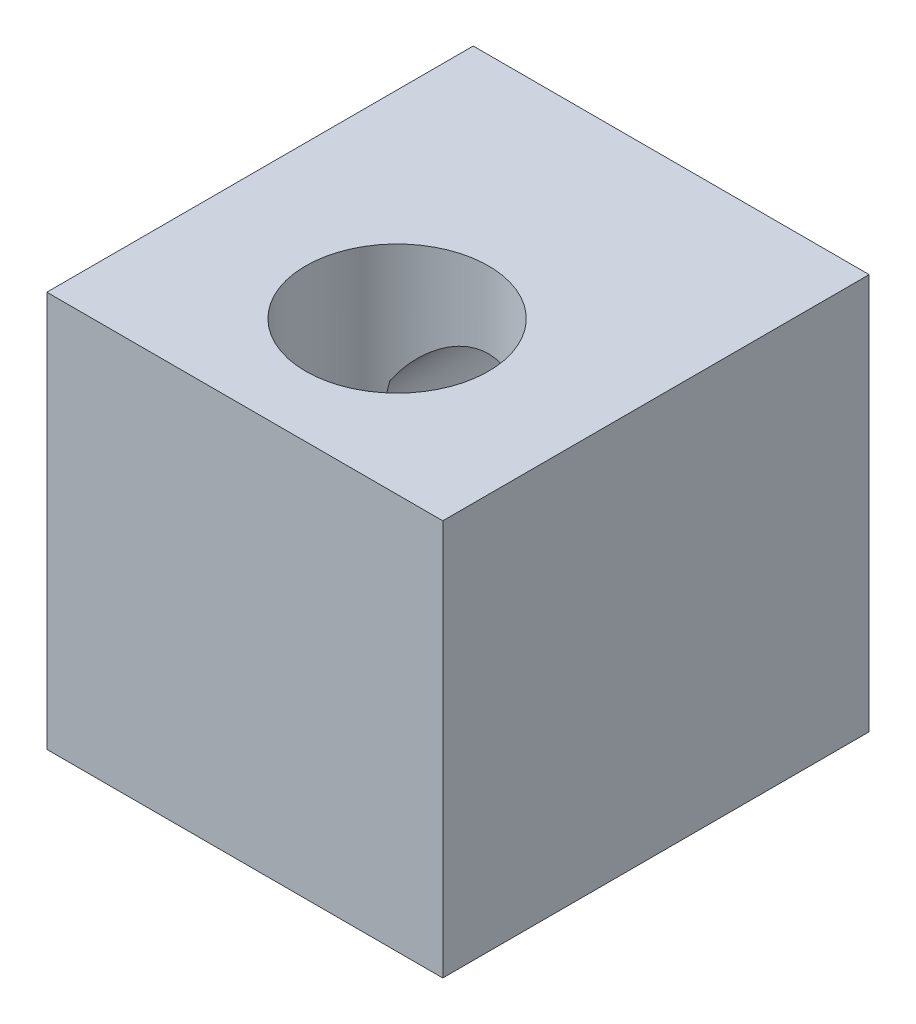
ISO-10303-21;
HEADER;
FILE_DESCRIPTION(('STEP AP214'),'2;1');
FILE_NAME('part.step','',(''),(''),'','','');
FILE_SCHEMA(('AUTOMOTIVE_DESIGN { 1 0 10303 214 1 1 1 1 }'));
ENDSEC;
DATA;
#1=APPLICATION_CONTEXT('core data for automotive mechanical design processes');
#2=APPLICATION_PROTOCOL_DEFINITION('international standard','automotive_design',2000,#1);
#3=PRODUCT_CONTEXT('',#1,'mechanical');
#4=PRODUCT('Part','Part','',(#3));
#5=PRODUCT_RELATED_PRODUCT_CATEGORY('part','',(#4));
#6=PRODUCT_DEFINITION_FORMATION('','',#4);
#7=PRODUCT_DEFINITION_CONTEXT('part definition',#1,'design');
#8=PRODUCT_DEFINITION('design','',#6,#7);
#9=PRODUCT_DEFINITION_SHAPE('','',#8);
#10=(LENGTH_UNIT() NAMED_UNIT(*) SI_UNIT(.MILLI.,.METRE.));
#11=(NAMED_UNIT(*) PLANE_ANGLE_UNIT() SI_UNIT($,.RADIAN.));
#12=(NAMED_UNIT(*) SI_UNIT($,.STERADIAN.) SOLID_ANGLE_UNIT());
#13=UNCERTAINTY_MEASURE_WITH_UNIT(LENGTH_MEASURE(1.E-05),#10,'distance_accuracy_value','');
#14=(GEOMETRIC_REPRESENTATION_CONTEXT(3) GLOBAL_UNCERTAINTY_ASSIGNED_CONTEXT((#13)) GLOBAL_UNIT_ASSIGNED_CONTEXT((#10,
#11,#12)) REPRESENTATION_CONTEXT('',''));
#15=CARTESIAN_POINT('',(0.,0.,0.));
#16=DIRECTION('',(0.,0.,1.));
#17=DIRECTION('',(1.,0.,0.));
#18=AXIS2_PLACEMENT_3D('',#15,#16,#17);
#19=CARTESIAN_POINT('',(-6.5,6.5,14.));
#20=DIRECTION('',(0.,-1.,0.));
#21=DIRECTION('',(0.,0.,-1.));
#22=AXIS2_PLACEMENT_3D('',#19,#20,#21);
#23=PLANE('',#22);
#24=DIRECTION('',(-1.,0.,0.));
#25=VECTOR('',#24,1.);
#26=CARTESIAN_POINT('',(-6.5,6.5,0.));
#27=LINE('',#26,#25);
#28=CARTESIAN_POINT('',(6.5,6.5,0.));
#29=VERTEX_POINT('',#28);
#30=CARTESIAN_POINT('',(-6.5,6.5,0.));
#31=VERTEX_POINT('',#30);
#32=EDGE_CURVE('E106',#29,#31,#27,.T.);
#33=ORIENTED_EDGE('',*,*,#32,.T.);
#34=DIRECTION('',(0.,0.,-1.));
#35=VECTOR('',#34,1.);
#36=CARTESIAN_POINT('',(-6.5,6.5,14.));
#37=LINE('',#36,#35);
#38=CARTESIAN_POINT('',(-6.5,6.5,14.));
#39=VERTEX_POINT('',#38);
#40=EDGE_CURVE('E179',#39,#31,#37,.T.);
#41=ORIENTED_EDGE('',*,*,#40,.F.);
#42=DIRECTION('',(-1.,0.,0.));
#43=VECTOR('',#42,1.);
#44=CARTESIAN_POINT('',(-6.5,6.5,14.));
#45=LINE('',#44,#43);
#46=CARTESIAN_POINT('',(6.5,6.5,14.));
#47=VERTEX_POINT('',#46);
#48=EDGE_CURVE('E85',#47,#39,#45,.T.);
#49=ORIENTED_EDGE('',*,*,#48,.F.);
#50=DIRECTION('',(0.,0.,-1.));
#51=VECTOR('',#50,1.);
#52=CARTESIAN_POINT('',(6.5,6.5,14.));
#53=LINE('',#52,#51);
#54=EDGE_CURVE('E176',#47,#29,#53,.T.);
#55=ORIENTED_EDGE('',*,*,#54,.T.);
#56=EDGE_LOOP('',(#33,#41,#49,#55));
#57=FACE_BOUND('',#56,.T.);
#58=CARTESIAN_POINT('',(0.,6.5,9.));
#59=DIRECTION('',(0.,1.,0.));
#60=DIRECTION('',(0.,0.,1.));
#61=AXIS2_PLACEMENT_3D('',#58,#59,#60);
#62=CIRCLE('',#61,3.);
#63=CARTESIAN_POINT('',(0.,6.5,12.));
#64=VERTEX_POINT('',#63);
#65=EDGE_CURVE('E135',#64,#64,#62,.T.);
#66=ORIENTED_EDGE('',*,*,#65,.F.);
#67=EDGE_LOOP('',(#66));
#68=FACE_BOUND('',#67,.T.);
#69=ADVANCED_FACE('F55',(#57,#68),#23,.F.);
#70=CARTESIAN_POINT('',(-6.5,-6.5,14.));
#71=DIRECTION('',(1.,0.,0.));
#72=DIRECTION('',(0.,1.,0.));
#73=AXIS2_PLACEMENT_3D('',#70,#71,#72);
#74=PLANE('',#73);
#75=DIRECTION('',(0.,-1.,0.));
#76=VECTOR('',#75,1.);
#77=CARTESIAN_POINT('',(-6.5,-6.5,0.));
#78=LINE('',#77,#76);
#79=CARTESIAN_POINT('',(-6.5,-6.5,0.));
#80=VERTEX_POINT('',#79);
#81=EDGE_CURVE('E191',#31,#80,#78,.T.);
#82=ORIENTED_EDGE('',*,*,#81,.T.);
#83=DIRECTION('',(0.,0.,-1.));
#84=VECTOR('',#83,1.);
#85=CARTESIAN_POINT('',(-6.5,-6.5,14.));
#86=LINE('',#85,#84);
#87=CARTESIAN_POINT('',(-6.5,-6.5,14.));
#88=VERTEX_POINT('',#87);
#89=EDGE_CURVE('E169',#88,#80,#86,.T.);
#90=ORIENTED_EDGE('',*,*,#89,.F.);
#91=DIRECTION('',(0.,-1.,0.));
#92=VECTOR('',#91,1.);
#93=CARTESIAN_POINT('',(-6.5,-6.5,14.));
#94=LINE('',#93,#92);
#95=EDGE_CURVE('E184',#39,#88,#94,.T.);
#96=ORIENTED_EDGE('',*,*,#95,.F.);
#97=ORIENTED_EDGE('',*,*,#40,.T.);
#98=EDGE_LOOP('',(#82,#90,#96,#97));
#99=FACE_BOUND('',#98,.T.);
#100=ADVANCED_FACE('F57',(#99),#74,.F.);
#101=CARTESIAN_POINT('',(-6.5,-6.5,14.));
#102=DIRECTION('',(0.,1.,0.));
#103=DIRECTION('',(-1.,0.,0.));
#104=AXIS2_PLACEMENT_3D('',#101,#102,#103);
#105=PLANE('',#104);
#106=CARTESIAN_POINT('',(0.,-6.5,9.));
#107=DIRECTION('',(0.,1.,0.));
#108=DIRECTION('',(-1.,0.,0.));
#109=AXIS2_PLACEMENT_3D('',#106,#107,#108);
#110=CIRCLE('',#109,3.);
#111=CARTESIAN_POINT('',(-2.99999999999997,-6.5,9.));
#112=VERTEX_POINT('',#111);
#113=EDGE_CURVE('E195',#112,#112,#110,.T.);
#114=ORIENTED_EDGE('',*,*,#113,.T.);
#115=EDGE_LOOP('',(#114));
#116=FACE_BOUND('',#115,.T.);
#117=DIRECTION('',(1.,0.,0.));
#118=VECTOR('',#117,1.);
#119=CARTESIAN_POINT('',(-6.5,-6.5,0.));
#120=LINE('',#119,#118);
#121=CARTESIAN_POINT('',(6.5,-6.5,0.));
#122=VERTEX_POINT('',#121);
#123=EDGE_CURVE('E188',#80,#122,#120,.T.);
#124=ORIENTED_EDGE('',*,*,#123,.T.);
#125=DIRECTION('',(0.,0.,-1.));
#126=VECTOR('',#125,1.);
#127=CARTESIAN_POINT('',(6.5,-6.5,14.));
#128=LINE('',#127,#126);
#129=CARTESIAN_POINT('',(6.5,-6.5,14.));
#130=VERTEX_POINT('',#129);
#131=EDGE_CURVE('E172',#130,#122,#128,.T.);
#132=ORIENTED_EDGE('',*,*,#131,.F.);
#133=DIRECTION('',(1.,0.,0.));
#134=VECTOR('',#133,1.);
#135=CARTESIAN_POINT('',(-6.5,-6.5,14.));
#136=LINE('',#135,#134);
#137=EDGE_CURVE('E114',#88,#130,#136,.T.);
#138=ORIENTED_EDGE('',*,*,#137,.F.);
#139=ORIENTED_EDGE('',*,*,#89,.T.);
#140=EDGE_LOOP('',(#124,#132,#138,#139));
#141=FACE_BOUND('',#140,.T.);
#142=ADVANCED_FACE('F232',(#116,#141),#105,.F.);
#143=CARTESIAN_POINT('',(6.5,-6.5,14.));
#144=DIRECTION('',(-1.,0.,0.));
#145=DIRECTION('',(0.,-1.,0.));
#146=AXIS2_PLACEMENT_3D('',#143,#144,#145);
#147=PLANE('',#146);
#148=DIRECTION('',(0.,1.,0.));
#149=VECTOR('',#148,1.);
#150=CARTESIAN_POINT('',(6.5,-6.5,0.));
#151=LINE('',#150,#149);
#152=EDGE_CURVE('E185',#122,#29,#151,.T.);
#153=ORIENTED_EDGE('',*,*,#152,.T.);
#154=ORIENTED_EDGE('',*,*,#54,.F.);
#155=DIRECTION('',(0.,1.,0.));
#156=VECTOR('',#155,1.);
#157=CARTESIAN_POINT('',(6.5,-6.5,14.));
#158=LINE('',#157,#156);
#159=EDGE_CURVE('E198',#130,#47,#158,.T.);
#160=ORIENTED_EDGE('',*,*,#159,.F.);
#161=ORIENTED_EDGE('',*,*,#131,.T.);
#162=EDGE_LOOP('',(#153,#154,#160,#161));
#163=FACE_BOUND('',#162,.T.);
#164=ADVANCED_FACE('F231',(#163),#147,.F.);
#165=CARTESIAN_POINT('',(0.,0.,14.));
#166=DIRECTION('',(0.,0.,-1.));
#167=DIRECTION('',(-1.,0.,0.));
#168=AXIS2_PLACEMENT_3D('',#165,#166,#167);
#169=PLANE('',#168);
#170=ORIENTED_EDGE('',*,*,#95,.T.);
#171=ORIENTED_EDGE('',*,*,#137,.T.);
#172=ORIENTED_EDGE('',*,*,#159,.T.);
#173=ORIENTED_EDGE('',*,*,#48,.T.);
#174=EDGE_LOOP('',(#170,#171,#172,#173));
#175=FACE_BOUND('',#174,.T.);
#176=ADVANCED_FACE('F220',(#175),#169,.F.);
#177=CARTESIAN_POINT('',(0.,0.,0.));
#178=DIRECTION('',(0.,0.,-1.));
#179=DIRECTION('',(-1.,0.,0.));
#180=AXIS2_PLACEMENT_3D('',#177,#178,#179);
#181=PLANE('',#180);
#182=CARTESIAN_POINT('',(0.,1.5,0.));
#183=DIRECTION('',(0.,0.,-1.));
#184=DIRECTION('',(-1.,0.,0.));
#185=AXIS2_PLACEMENT_3D('',#182,#183,#184);
#186=CIRCLE('',#185,2.5);
#187=CARTESIAN_POINT('',(-2.5,1.5,0.));
#188=VERTEX_POINT('',#187);
#189=EDGE_CURVE('E212',#188,#188,#186,.T.);
#190=ORIENTED_EDGE('',*,*,#189,.F.);
#191=EDGE_LOOP('',(#190));
#192=FACE_BOUND('',#191,.T.);
#193=ORIENTED_EDGE('',*,*,#81,.F.);
#194=ORIENTED_EDGE('',*,*,#32,.F.);
#195=ORIENTED_EDGE('',*,*,#152,.F.);
#196=ORIENTED_EDGE('',*,*,#123,.F.);
#197=EDGE_LOOP('',(#193,#194,#195,#196));
#198=FACE_BOUND('',#197,.T.);
#199=ADVANCED_FACE('F217',(#192,#198),#181,.T.);
#200=CARTESIAN_POINT('',(0.,6.5,9.));
#201=DIRECTION('',(0.,1.,0.));
#202=DIRECTION('',(0.,0.,1.));
#203=AXIS2_PLACEMENT_3D('',#200,#201,#202);
#204=CYLINDRICAL_SURFACE('',#203,3.);
#205=CARTESIAN_POINT('',(-2.23606797749976,2.61803398874995,7.));
#206=CARTESIAN_POINT('',(-2.20123612885053,2.68762327068819,6.96102651964688));
#207=CARTESIAN_POINT('',(-2.1634881527641,2.75506610071388,6.92089995142085));
#208=CARTESIAN_POINT('',(-2.08223233673713,2.88574013362121,6.83954140473405));
#209=CARTESIAN_POINT('',(-2.03872187502526,2.94896939964655,6.79830892996707));
#210=CARTESIAN_POINT('',(-1.94567645710564,3.07172093009555,6.71564934528032));
#211=CARTESIAN_POINT('',(-1.8960962868153,3.13120966633421,6.67422330000638));
#212=CARTESIAN_POINT('',(-1.79122223158823,3.24572417198187,6.59252389029124));
#213=CARTESIAN_POINT('',(-1.73592988619508,3.30075113682668,6.55225021898002));
#214=CARTESIAN_POINT('',(-1.58237658949669,3.43975161304301,6.44866516919045));
#215=CARTESIAN_POINT('',(-1.47923798054959,3.51974993226354,6.38707959727085));
#216=CARTESIAN_POINT('',(-1.25821663238237,3.66430823028611,6.27378727218286));
#217=CARTESIAN_POINT('',(-1.14038553895402,3.728920086511,6.22204744489798));
#218=CARTESIAN_POINT('',(-0.914356791417769,3.82944203666136,6.1406990678104));
#219=CARTESIAN_POINT('',(-0.808382657839993,3.8684467430356,6.10876944736622));
#220=CARTESIAN_POINT('',(-0.589462385689458,3.93218126254479,6.05633301652564));
#221=CARTESIAN_POINT('',(-0.476518209448921,3.95691507336718,6.0358230072248));
#222=CARTESIAN_POINT('',(-0.246139320357337,3.99058594001957,6.00785545459845));
#223=CARTESIAN_POINT('',(-0.128686659090571,3.99945127988828,6.00045716987416));
#224=CARTESIAN_POINT('',(0.106341037648499,4.00049878733918,5.99958444069426));
#225=CARTESIAN_POINT('',(0.223916056224675,3.99268301422078,6.00610827753938));
#226=CARTESIAN_POINT('',(0.446543405401701,3.96216893599561,6.03146294446568));
#227=CARTESIAN_POINT('',(0.551872049342916,3.94063555250939,6.04933010790713));
#228=CARTESIAN_POINT('',(0.75682052400645,3.88505856852006,6.09513202189542));
#229=CARTESIAN_POINT('',(0.856440216648438,3.85101466557708,6.12306701583021));
#230=CARTESIAN_POINT('',(1.05555205794833,3.76897968443745,6.18972416723484));
#231=CARTESIAN_POINT('',(1.15446691038405,3.72012976387125,6.22910143660002));
#232=CARTESIAN_POINT('',(1.34272004963287,3.61162015504217,6.31525401975959));
#233=CARTESIAN_POINT('',(1.43204498407414,3.5519456983253,6.36203942962856));
#234=CARTESIAN_POINT('',(1.64097158989833,3.39256309560509,6.48444599051273));
#235=CARTESIAN_POINT('',(1.75463336457562,3.28735438725084,6.56316008397188));
#236=CARTESIAN_POINT('',(1.90820202560344,3.1169772091054,6.68417526449315));
#237=CARTESIAN_POINT('',(1.95658230109076,3.05807219275922,6.72501640669676));
#238=CARTESIAN_POINT('',(2.04776204772324,2.93612658892111,6.80673714086553));
#239=CARTESIAN_POINT('',(2.09056519141546,2.87308876442454,6.84761668949101));
#240=CARTESIAN_POINT('',(2.14941173329446,2.77723579914751,6.90697560739739));
#241=CARTESIAN_POINT('',(2.1676594068462,2.74602132273747,6.92589467519221));
#242=CARTESIAN_POINT('',(2.20284034825772,2.68270919027969,6.96329860445765));
#243=CARTESIAN_POINT('',(2.21977612803637,2.65061338985807,6.98178424596843));
#244=CARTESIAN_POINT('',(2.23606797749982,2.61803398874983,7.));
#245=B_SPLINE_CURVE_WITH_KNOTS('',3,(#205,#206,#207,#208,#209,#210,#211,#212,#213,#214,#215,
#216,#217,#218,#219,#220,#221,#222,#223,#224,#225,#226,#227,#228,#229,#230,#231,#232,#233,#234,
#235,#236,#237,#238,#239,#240,#241,#242,#243,#244),.UNSPECIFIED.,.F.,.F.,(4,2,2,2,2,2,2,2,2,2,2,
2,2,2,2,2,2,2,2,4),(0.,0.260971229663842,0.522061604539038,0.785231042257519,1.04832973477045,
1.4795699178372,1.90933485430472,2.25993666357205,2.61044021146635,2.96252386321722,
3.31456405241755,3.64009669333581,3.96563720447367,4.31575193582946,4.66634798902443,
5.18454713748362,5.44379471598527,5.7028707075075,5.82526653991318,5.94742190685283),.UNSPECIFIED.);
#246=CARTESIAN_POINT('',(-2.23606797749976,2.61803398874995,7.));
#247=VERTEX_POINT('',#246);
#248=CARTESIAN_POINT('',(2.23606797749982,2.61803398874983,7.));
#249=VERTEX_POINT('',#248);
#250=EDGE_CURVE('E70',#247,#249,#245,.T.);
#251=ORIENTED_EDGE('',*,*,#250,.T.);
#252=CARTESIAN_POINT('',(1.36985395398186,4.84365729073391,6.33101140040645));
#253=CARTESIAN_POINT('',(1.40523094190352,4.79649206612945,6.34917432186328));
#254=CARTESIAN_POINT('',(1.43925644175582,4.74841232124363,6.36752044041918));
#255=CARTESIAN_POINT('',(1.50478443944225,4.65067061300998,6.4044184189419));
#256=CARTESIAN_POINT('',(1.53628805191298,4.60100936238286,6.42297018384208));
#257=CARTESIAN_POINT('',(1.62724389452552,4.45010354216368,6.47866440009396));
#258=CARTESIAN_POINT('',(1.68324149566147,4.34680029219836,6.51589875578634));
#259=CARTESIAN_POINT('',(1.78667022499223,4.13688644206711,6.58923525262325));
#260=CARTESIAN_POINT('',(1.83417146775381,4.03031231708401,6.62534441456549));
#261=CARTESIAN_POINT('',(1.92200678047309,3.81369515512234,6.69586033804092));
#262=CARTESIAN_POINT('',(1.96234008366423,3.70365174850954,6.73026691716224));
#263=CARTESIAN_POINT('',(2.03285566495234,3.4911501419209,6.79330219275094));
#264=CARTESIAN_POINT('',(2.06363748282663,3.38896024037133,6.8221695079781));
#265=CARTESIAN_POINT('',(2.12369940929951,3.1688367663265,6.88059458032322));
#266=CARTESIAN_POINT('',(2.15225350396098,3.05059565747683,6.90974664376392));
#267=CARTESIAN_POINT('',(2.20289373520904,2.81160389737601,6.96318508316978));
#268=CARTESIAN_POINT('',(2.22497777273052,2.69085244527711,6.98746987925369));
#269=CARTESIAN_POINT('',(2.26269323973236,2.44724305430354,7.02996701573209));
#270=CARTESIAN_POINT('',(2.27832324747656,2.32438465749868,7.0481780179816));
#271=CARTESIAN_POINT('',(2.30305446331511,2.0771660093173,7.07742160428264));
#272=CARTESIAN_POINT('',(2.31215631804953,1.95280590793191,7.08845489930517));
#273=CARTESIAN_POINT('',(2.3246929458442,1.68296424846642,7.10370647967253));
#274=CARTESIAN_POINT('',(2.32696235963611,1.53734356170287,7.10652101867991));
#275=CARTESIAN_POINT('',(2.32251702502425,1.24641629194622,7.10107322122297));
#276=CARTESIAN_POINT('',(2.31579965714836,1.10110981290567,7.09280765512205));
#277=CARTESIAN_POINT('',(2.29348876265806,0.812290217129679,7.06603883648134));
#278=CARTESIAN_POINT('',(2.27790289452314,0.668775662096298,7.04754441755204));
#279=CARTESIAN_POINT('',(2.23798908508343,0.384368886028936,7.00192148706925));
#280=CARTESIAN_POINT('',(2.21366078300024,0.243476773469016,6.97479261919893));
#281=CARTESIAN_POINT('',(2.17141008227788,0.0385058585246893,6.92988720041819));
#282=CARTESIAN_POINT('',(2.15688002228055,-0.0268805792021828,6.91472803081118));
#283=CARTESIAN_POINT('',(2.1258422485827,-0.15687429402606,6.88309515688945));
#284=CARTESIAN_POINT('',(2.10933422679283,-0.221481448011541,6.86662124792338));
#285=CARTESIAN_POINT('',(2.05994313670565,-0.402505043592387,6.81857518953224));
#286=CARTESIAN_POINT('',(2.02473466161122,-0.517952432957705,6.78570192065914));
#287=CARTESIAN_POINT('',(1.94727929033898,-0.745725978474643,6.71728738640495));
#288=CARTESIAN_POINT('',(1.90502850735378,-0.858050370806482,6.68174465367172));
#289=CARTESIAN_POINT('',(1.81295834592675,-1.07883006225504,6.60905437849056));
#290=CARTESIAN_POINT('',(1.76314980680771,-1.18729063209725,6.57190918803231));
#291=CARTESIAN_POINT('',(1.6550597283957,-1.39960975924574,6.4969810398691));
#292=CARTESIAN_POINT('',(1.59678533528356,-1.50347210246669,6.45919864358407));
#293=CARTESIAN_POINT('',(1.49481116030419,-1.66644569388374,6.39854220579616));
#294=CARTESIAN_POINT('',(1.45413453758382,-1.72739499751307,6.37552718101756));
#295=CARTESIAN_POINT('',(1.36869331503369,-1.84657076906619,6.32998106805673));
#296=CARTESIAN_POINT('',(1.32392740387254,-1.90479635444762,6.30745013799263));
#297=CARTESIAN_POINT('',(1.27692580381706,-1.9613975366597,6.28532497496547));
#298=B_SPLINE_CURVE_WITH_KNOTS('',3,(#252,#253,#254,#255,#256,#257,#258,#259,#260,#261,#262,
#263,#264,#265,#266,#267,#268,#269,#270,#271,#272,#273,#274,#275,#276,#277,#278,#279,#280,#281,
#282,#283,#284,#285,#286,#287,#288,#289,#290,#291,#292,#293,#294,#295,#296,#297),.UNSPECIFIED.,
.F.,.F.,(4,2,2,2,2,2,2,2,2,2,2,2,2,2,2,2,2,2,2,2,2,2,4),(0.,0.185021124772986,0.369960016195181,
0.739306986863725,1.10544916504736,1.47163048653216,1.80314166609419,2.17811694927025,
2.55321375040502,2.92839313630753,3.30353535403353,3.73981696685342,4.17622577499063,
4.61225828877673,5.04830879860142,5.25429850913908,5.46032034665748,5.83532124152159,
6.21052979731039,6.58520522887571,6.95956620824979,7.18983945843716,7.4201868124068),.UNSPECIFIED.);
#299=CARTESIAN_POINT('',(2.23606797749982,0.381966011250171,7.));
#300=VERTEX_POINT('',#299);
#301=EDGE_CURVE('E13',#249,#300,#298,.T.);
#302=ORIENTED_EDGE('',*,*,#301,.T.);
#303=CARTESIAN_POINT('',(2.23606797749982,0.381966011250171,7.));
#304=CARTESIAN_POINT('',(2.20123612885059,0.312376729311925,6.96102651964689));
#305=CARTESIAN_POINT('',(2.16348815276417,0.244933899286239,6.92089995142086));
#306=CARTESIAN_POINT('',(2.08223233673721,0.114259866378901,6.83954140473406));
#307=CARTESIAN_POINT('',(2.03872187502534,0.0510306003535575,6.79830892996708));
#308=CARTESIAN_POINT('',(1.94567645710572,-0.0717209300954524,6.71564934528034));
#309=CARTESIAN_POINT('',(1.89609628681539,-0.131209666334106,6.6742233000064));
#310=CARTESIAN_POINT('',(1.79122223158832,-0.245724171981779,6.59252389029127));
#311=CARTESIAN_POINT('',(1.73592988619518,-0.300751136826591,6.55225021898005));
#312=CARTESIAN_POINT('',(1.5823765894968,-0.439751613042925,6.44866516919048));
#313=CARTESIAN_POINT('',(1.47923798054969,-0.519749932263464,6.38707959727087));
#314=CARTESIAN_POINT('',(1.25821663238247,-0.664308230286054,6.27378727218288));
#315=CARTESIAN_POINT('',(1.14038553895413,-0.728920086510954,6.222047444898));
#316=CARTESIAN_POINT('',(0.914356791417872,-0.829442036661317,6.14069906781041));
#317=CARTESIAN_POINT('',(0.808382657840096,-0.868446743035563,6.10876944736624));
#318=CARTESIAN_POINT('',(0.589462385689562,-0.932181262544763,6.05633301652565));
#319=CARTESIAN_POINT('',(0.476518209449025,-0.956915073367161,6.03582300722481));
#320=CARTESIAN_POINT('',(0.24613932035744,-0.990585940019559,6.00785545459845));
#321=CARTESIAN_POINT('',(0.128686659090673,-0.999451279888275,6.00045716987416));
#322=CARTESIAN_POINT('',(-0.106341037648401,-1.00049878733919,5.99958444069426));
#323=CARTESIAN_POINT('',(-0.22391605622458,-0.992683014220791,6.00610827753938));
#324=CARTESIAN_POINT('',(-0.446543405401609,-0.962168935995633,6.03146294446568));
#325=CARTESIAN_POINT('',(-0.551872049342824,-0.940635552509409,6.04933010790713));
#326=CARTESIAN_POINT('',(-0.756820524006361,-0.885058568520094,6.09513202189541));
#327=CARTESIAN_POINT('',(-0.856440216648351,-0.851014665577109,6.1230670158302));
#328=CARTESIAN_POINT('',(-1.05555205794825,-0.76897968443749,6.18972416723483));
#329=CARTESIAN_POINT('',(-1.15446691038396,-0.720129763871292,6.22910143660001));
#330=CARTESIAN_POINT('',(-1.34272004963279,-0.611620155042228,6.31525401975958));
#331=CARTESIAN_POINT('',(-1.43204498407406,-0.551945698325359,6.36203942962855));
#332=CARTESIAN_POINT('',(-1.64097158989826,-0.392563095605158,6.48444599051272));
#333=CARTESIAN_POINT('',(-1.75463336457555,-0.287354387250913,6.56316008397187));
#334=CARTESIAN_POINT('',(-1.90820202560337,-0.116977209105487,6.68417526449314));
#335=CARTESIAN_POINT('',(-1.95658230109069,-0.0580721927593085,6.72501640669676));
#336=CARTESIAN_POINT('',(-2.04776204772317,0.0638734110787937,6.80673714086553));
#337=CARTESIAN_POINT('',(-2.0905651914154,0.126911235575364,6.84761668949101));
#338=CARTESIAN_POINT('',(-2.1494117332944,0.22276420085239,6.90697560739739));
#339=CARTESIAN_POINT('',(-2.16765940684615,0.253978677262424,6.92589467519221));
#340=CARTESIAN_POINT('',(-2.20284034825766,0.317290809720196,6.96329860445765));
#341=CARTESIAN_POINT('',(-2.21977612803631,0.349386610141814,6.98178424596843));
#342=CARTESIAN_POINT('',(-2.23606797749976,0.381966011250049,7.));
#343=B_SPLINE_CURVE_WITH_KNOTS('',3,(#303,#304,#305,#306,#307,#308,#309,#310,#311,#312,#313,
#314,#315,#316,#317,#318,#319,#320,#321,#322,#323,#324,#325,#326,#327,#328,#329,#330,#331,#332,
#333,#334,#335,#336,#337,#338,#339,#340,#341,#342),.UNSPECIFIED.,.F.,.F.,(4,2,2,2,2,2,2,2,2,2,2,
2,2,2,2,2,2,2,2,4),(0.,0.260971229663838,0.522061604539031,0.785231042257508,1.04832973477044,
1.4795699178372,1.90933485430473,2.25993666357207,2.61044021146638,2.96252386321725,
3.31456405241758,3.64009669333585,3.9656372044737,4.31575193582949,4.66634798902446,
5.18454713748364,5.44379471598529,5.70287070750752,5.82526653991319,5.94742190685283),.UNSPECIFIED.);
#344=CARTESIAN_POINT('',(-2.23606797749976,0.38196601125005,7.));
#345=VERTEX_POINT('',#344);
#346=EDGE_CURVE('E133',#300,#345,#343,.T.);
#347=ORIENTED_EDGE('',*,*,#346,.T.);
#348=CARTESIAN_POINT('',(-1.27692580381702,-1.9613975366597,6.28532497496548));
#349=CARTESIAN_POINT('',(-1.31018130903265,-1.92137007068073,6.30097175757955));
#350=CARTESIAN_POINT('',(-1.34231212837665,-1.88051436994246,6.31682733768811));
#351=CARTESIAN_POINT('',(-1.40446195178865,-1.79736425318634,6.34882807727992));
#352=CARTESIAN_POINT('',(-1.43448186839798,-1.75507047072754,6.36497310779855));
#353=CARTESIAN_POINT('',(-1.52152389748029,-1.6264517097418,6.41361576690466));
#354=CARTESIAN_POINT('',(-1.5756409202045,-1.538251117601,6.44637527714643));
#355=CARTESIAN_POINT('',(-1.67665345892139,-1.35866067647016,6.51154365158548));
#356=CARTESIAN_POINT('',(-1.72359844550095,-1.26729855731171,6.54395333683199));
#357=CARTESIAN_POINT('',(-1.81145360817229,-1.08143558473171,6.60801541565737));
#358=CARTESIAN_POINT('',(-1.85236197137136,-0.986933798815578,6.63966757935933));
#359=CARTESIAN_POINT('',(-1.92960482740429,-0.792858422946842,6.70235768787728));
#360=CARTESIAN_POINT('',(-1.96579742386437,-0.693217006331301,6.73335983525023));
#361=CARTESIAN_POINT('',(-2.03280775901708,-0.491310397878163,6.793257038595));
#362=CARTESIAN_POINT('',(-2.06361559771932,-0.389040761698603,6.82214815782971));
#363=CARTESIAN_POINT('',(-2.1237144610813,-0.168781247721986,6.88060929141156));
#364=CARTESIAN_POINT('',(-2.15228034125653,-0.0504844707934193,6.90977405813002));
#365=CARTESIAN_POINT('',(-2.20293538220563,0.188608140971155,6.96322993936874));
#366=CARTESIAN_POINT('',(-2.22502316387434,0.309404502085867,6.98752001578213));
#367=CARTESIAN_POINT('',(-2.26272689807728,0.553010642869401,7.03000595692983));
#368=CARTESIAN_POINT('',(-2.27834640903744,0.67581927675237,7.04820517140412));
#369=CARTESIAN_POINT('',(-2.30306199345092,0.922936883704791,7.07743074329077));
#370=CARTESIAN_POINT('',(-2.31215871499564,1.04724570647015,7.08845781330306));
#371=CARTESIAN_POINT('',(-2.32469096826892,1.31699316020757,7.10370407619716));
#372=CARTESIAN_POINT('',(-2.32696103107004,1.46257092974046,7.10651939595718));
#373=CARTESIAN_POINT('',(-2.32252228428676,1.75341191484581,7.10107966296619));
#374=CARTESIAN_POINT('',(-2.31581092325765,1.89867502928742,7.09282146444654));
#375=CARTESIAN_POINT('',(-2.29351061559603,2.18749610616378,7.06606477063192));
#376=CARTESIAN_POINT('',(-2.27792400818452,2.33105450773051,7.04756897366473));
#377=CARTESIAN_POINT('',(-2.23800350847691,2.61554772192912,7.00193755405435));
#378=CARTESIAN_POINT('',(-2.21366927357247,2.75648243157443,6.97480159301648));
#379=CARTESIAN_POINT('',(-2.17140244137223,2.96153102299245,6.92987910315435));
#380=CARTESIAN_POINT('',(-2.15686364754228,3.02695373870788,6.91471101374873));
#381=CARTESIAN_POINT('',(-2.12582360255963,3.15694780181809,6.88307648363519));
#382=CARTESIAN_POINT('',(-2.10932427186536,3.22151991464658,6.86661131873097));
#383=CARTESIAN_POINT('',(-2.07133279029501,3.36075843390063,6.82965496415482));
#384=CARTESIAN_POINT('',(-2.04946901790841,3.43526851403253,6.80895602047761));
#385=CARTESIAN_POINT('',(-2.00289404265284,3.58306020123229,6.76630063940586));
#386=CARTESIAN_POINT('',(-1.97818171613809,3.6563413103716,6.74434370751255));
#387=CARTESIAN_POINT('',(-1.91617530488162,3.82818503554034,6.69121272704662));
#388=CARTESIAN_POINT('',(-1.87759211788399,3.92615619276723,6.65961326007526));
#389=CARTESIAN_POINT('',(-1.79444048321145,4.11912891861017,6.59526539519612));
#390=CARTESIAN_POINT('',(-1.74987258869241,4.21413076067552,6.56251710367856));
#391=CARTESIAN_POINT('',(-1.65393563660099,4.40093238873655,6.49642130617977));
#392=CARTESIAN_POINT('',(-1.60254309439939,4.49271966862913,6.46307209123672));
#393=CARTESIAN_POINT('',(-1.5197871447684,4.62704817544677,6.41324845502827));
#394=CARTESIAN_POINT('',(-1.49123826729868,4.67129142409158,6.3966639427083));
#395=CARTESIAN_POINT('',(-1.43210601145846,4.75848793695584,6.36367402355969));
#396=CARTESIAN_POINT('',(-1.40152193896683,4.80144075373738,6.34726868008192));
#397=CARTESIAN_POINT('',(-1.36985395398182,4.84365729073391,6.33101140040646));
#398=B_SPLINE_CURVE_WITH_KNOTS('',3,(#348,#349,#350,#351,#352,#353,#354,#355,#356,#357,#358,
#359,#360,#361,#362,#363,#364,#365,#366,#367,#368,#369,#370,#371,#372,#373,#374,#375,#376,#377,
#378,#379,#380,#381,#382,#383,#384,#385,#386,#387,#388,#389,#390,#391,#392,#393,#394,#395,#396,
#397),.UNSPECIFIED.,.F.,.F.,(4,2,2,2,2,2,2,2,2,2,2,2,2,2,2,2,2,2,2,2,2,2,2,2,4),(0.,
0.162975908392203,0.325880923701033,0.651133851903379,0.974030758448083,1.297024439507,
1.62818949215568,1.95995713679604,2.33510838142292,2.71033943312685,3.08536378175937,
3.46035086355186,3.89650448465774,4.33278203467882,4.76894464957652,5.20512434901915,
5.41123024949192,5.61713589641732,5.85815321932676,6.09926594182399,6.42886375605041,
6.75843112707873,7.08916349072983,7.25473063368885,7.42035453709544),.UNSPECIFIED.);
#399=EDGE_CURVE('E139',#345,#247,#398,.T.);
#400=ORIENTED_EDGE('',*,*,#399,.T.);
#401=EDGE_LOOP('',(#251,#302,#347,#400));
#402=FACE_BOUND('',#401,.T.);
#403=ORIENTED_EDGE('',*,*,#113,.F.);
#404=EDGE_LOOP('',(#403));
#405=FACE_BOUND('',#404,.T.);
#406=ORIENTED_EDGE('',*,*,#65,.T.);
#407=EDGE_LOOP('',(#406));
#408=FACE_BOUND('',#407,.T.);
#409=ADVANCED_FACE('F137',(#402,#405,#408),#204,.F.);
#410=CARTESIAN_POINT('',(0.,1.5,0.));
#411=DIRECTION('',(0.,0.,-1.));
#412=DIRECTION('',(-1.,0.,0.));
#413=AXIS2_PLACEMENT_3D('',#410,#411,#412);
#414=CYLINDRICAL_SURFACE('',#413,2.5);
#415=ORIENTED_EDGE('',*,*,#189,.T.);
#416=EDGE_LOOP('',(#415));
#417=FACE_BOUND('',#416,.T.);
#418=CARTESIAN_POINT('',(0.,1.5,7.));
#419=DIRECTION('',(0.,0.,-1.));
#420=DIRECTION('',(-1.,0.,0.));
#421=AXIS2_PLACEMENT_3D('',#418,#419,#420);
#422=CIRCLE('',#421,2.5);
#423=EDGE_CURVE('E76',#345,#247,#422,.T.);
#424=ORIENTED_EDGE('',*,*,#423,.F.);
#425=ORIENTED_EDGE('',*,*,#346,.F.);
#426=EDGE_CURVE('E126',#249,#300,#422,.T.);
#427=ORIENTED_EDGE('',*,*,#426,.F.);
#428=ORIENTED_EDGE('',*,*,#250,.F.);
#429=EDGE_LOOP('',(#424,#425,#427,#428));
#430=FACE_BOUND('',#429,.T.);
#431=ADVANCED_FACE('F131',(#417,#430),#414,.F.);
#432=CARTESIAN_POINT('',(0.,1.5,7.));
#433=DIRECTION('',(0.,0.,-1.));
#434=DIRECTION('',(-1.,0.,0.));
#435=AXIS2_PLACEMENT_3D('',#432,#433,#434);
#436=CONICAL_SURFACE('',#435,2.5,1.02974425867665);
#437=ORIENTED_EDGE('',*,*,#426,.T.);
#438=ORIENTED_EDGE('',*,*,#301,.F.);
#439=EDGE_LOOP('',(#437,#438));
#440=FACE_BOUND('',#439,.T.);
#441=ADVANCED_FACE('F125',(#440),#436,.F.);
#442=ORIENTED_EDGE('',*,*,#423,.T.);
#443=ORIENTED_EDGE('',*,*,#399,.F.);
#444=EDGE_LOOP('',(#442,#443));
#445=FACE_BOUND('',#444,.T.);
#446=ADVANCED_FACE('F161',(#445),#436,.F.);
#447=CLOSED_SHELL('',(#69,#100,#142,#164,#176,#199,#409,#431,#441,#446));
#448=MANIFOLD_SOLID_BREP('B2',#447);
#449=ADVANCED_BREP_SHAPE_REPRESENTATION('',(#18,#448),#14);
#450=SHAPE_DEFINITION_REPRESENTATION(#9,#449);
ENDSEC;
END-ISO-10303-21;
